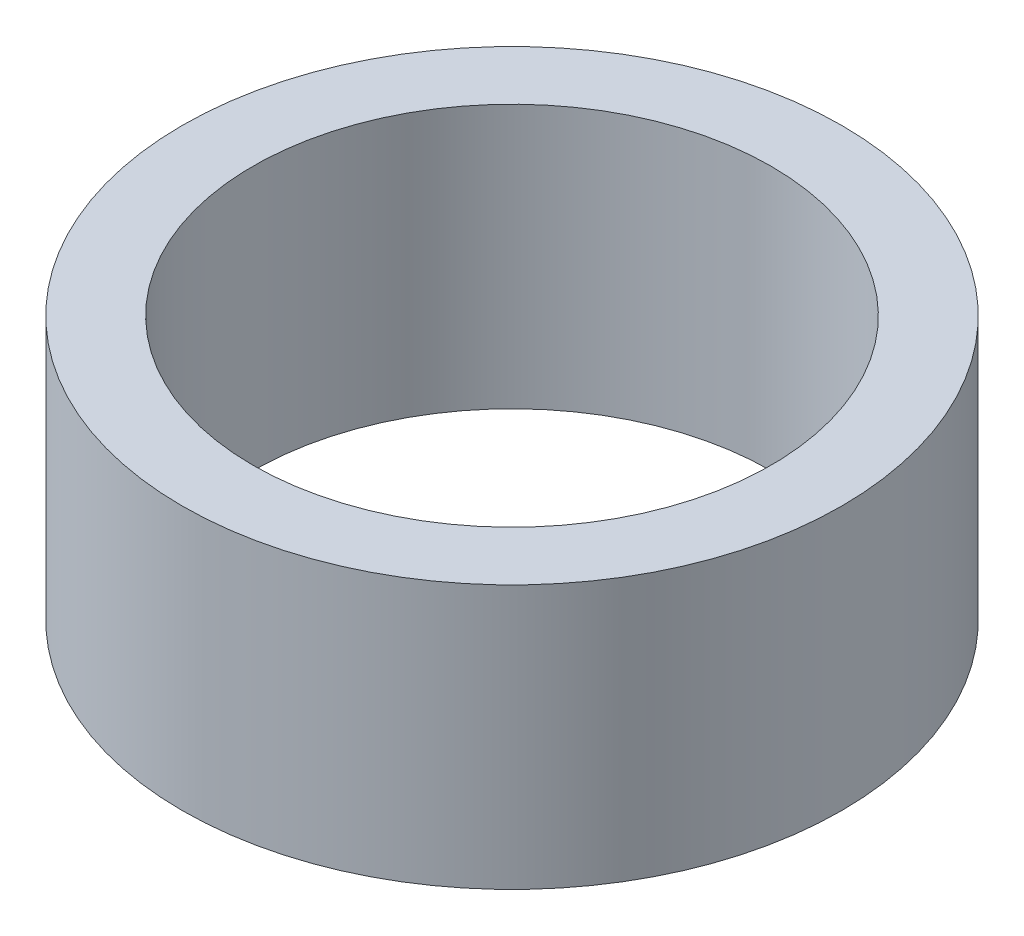
ISO-10303-21;
HEADER;
FILE_DESCRIPTION(('STEP AP214'),'2;1');
FILE_NAME('part.step','',(''),(''),'','','');
FILE_SCHEMA(('AUTOMOTIVE_DESIGN { 1 0 10303 214 1 1 1 1 }'));
ENDSEC;
DATA;
#1=APPLICATION_CONTEXT('core data for automotive mechanical design processes');
#2=APPLICATION_PROTOCOL_DEFINITION('international standard','automotive_design',2000,#1);
#3=PRODUCT_CONTEXT('',#1,'mechanical');
#4=PRODUCT('Part','Part','',(#3));
#5=PRODUCT_RELATED_PRODUCT_CATEGORY('part','',(#4));
#6=PRODUCT_DEFINITION_FORMATION('','',#4);
#7=PRODUCT_DEFINITION_CONTEXT('part definition',#1,'design');
#8=PRODUCT_DEFINITION('design','',#6,#7);
#9=PRODUCT_DEFINITION_SHAPE('','',#8);
#10=(LENGTH_UNIT() NAMED_UNIT(*) SI_UNIT(.MILLI.,.METRE.));
#11=(NAMED_UNIT(*) PLANE_ANGLE_UNIT() SI_UNIT($,.RADIAN.));
#12=(NAMED_UNIT(*) SI_UNIT($,.STERADIAN.) SOLID_ANGLE_UNIT());
#13=UNCERTAINTY_MEASURE_WITH_UNIT(LENGTH_MEASURE(1.E-05),#10,'distance_accuracy_value','');
#14=(GEOMETRIC_REPRESENTATION_CONTEXT(3) GLOBAL_UNCERTAINTY_ASSIGNED_CONTEXT((#13)) GLOBAL_UNIT_ASSIGNED_CONTEXT((#10,
#11,#12)) REPRESENTATION_CONTEXT('',''));
#15=CARTESIAN_POINT('',(0.,0.,0.));
#16=DIRECTION('',(0.,0.,1.));
#17=DIRECTION('',(1.,0.,0.));
#18=AXIS2_PLACEMENT_3D('',#15,#16,#17);
#19=CARTESIAN_POINT('',(0.,28.,0.));
#20=DIRECTION('',(0.,-1.,0.));
#21=DIRECTION('',(0.,0.,-1.));
#22=AXIS2_PLACEMENT_3D('',#19,#20,#21);
#23=CYLINDRICAL_SURFACE('',#22,35.);
#24=CARTESIAN_POINT('',(0.,28.,0.));
#25=DIRECTION('',(0.,1.,0.));
#26=DIRECTION('',(0.,0.,1.));
#27=AXIS2_PLACEMENT_3D('',#24,#25,#26);
#28=CIRCLE('',#27,35.);
#29=CARTESIAN_POINT('',(0.,28.,35.));
#30=VERTEX_POINT('',#29);
#31=EDGE_CURVE('E10',#30,#30,#28,.T.);
#32=ORIENTED_EDGE('',*,*,#31,.F.);
#33=EDGE_LOOP('',(#32));
#34=FACE_BOUND('',#33,.T.);
#35=CARTESIAN_POINT('',(0.,0.,0.));
#36=DIRECTION('',(0.,1.,0.));
#37=DIRECTION('',(0.,0.,1.));
#38=AXIS2_PLACEMENT_3D('',#35,#36,#37);
#39=CIRCLE('',#38,35.);
#40=CARTESIAN_POINT('',(0.,0.,35.));
#41=VERTEX_POINT('',#40);
#42=EDGE_CURVE('E37',#41,#41,#39,.T.);
#43=ORIENTED_EDGE('',*,*,#42,.T.);
#44=EDGE_LOOP('',(#43));
#45=FACE_BOUND('',#44,.T.);
#46=ADVANCED_FACE('F40',(#34,#45),#23,.T.);
#47=CARTESIAN_POINT('',(0.,28.,0.));
#48=DIRECTION('',(0.,1.,0.));
#49=DIRECTION('',(0.,0.,1.));
#50=AXIS2_PLACEMENT_3D('',#47,#48,#49);
#51=PLANE('',#50);
#52=CARTESIAN_POINT('',(0.,28.,0.));
#53=DIRECTION('',(0.,1.,0.));
#54=DIRECTION('',(0.,0.,1.));
#55=AXIS2_PLACEMENT_3D('',#52,#53,#54);
#56=CIRCLE('',#55,27.5);
#57=CARTESIAN_POINT('',(0.,28.,27.5));
#58=VERTEX_POINT('',#57);
#59=EDGE_CURVE('E50',#58,#58,#56,.T.);
#60=ORIENTED_EDGE('',*,*,#59,.F.);
#61=EDGE_LOOP('',(#60));
#62=FACE_BOUND('',#61,.T.);
#63=ORIENTED_EDGE('',*,*,#31,.T.);
#64=EDGE_LOOP('',(#63));
#65=FACE_BOUND('',#64,.T.);
#66=ADVANCED_FACE('F59',(#62,#65),#51,.T.);
#67=CARTESIAN_POINT('',(0.,0.,0.));
#68=DIRECTION('',(0.,1.,0.));
#69=DIRECTION('',(0.,0.,1.));
#70=AXIS2_PLACEMENT_3D('',#67,#68,#69);
#71=PLANE('',#70);
#72=CARTESIAN_POINT('',(0.,0.,0.));
#73=DIRECTION('',(0.,1.,0.));
#74=DIRECTION('',(0.,0.,1.));
#75=AXIS2_PLACEMENT_3D('',#72,#73,#74);
#76=CIRCLE('',#75,27.5);
#77=CARTESIAN_POINT('',(0.,0.,27.5));
#78=VERTEX_POINT('',#77);
#79=EDGE_CURVE('E47',#78,#78,#76,.T.);
#80=ORIENTED_EDGE('',*,*,#79,.T.);
#81=EDGE_LOOP('',(#80));
#82=FACE_BOUND('',#81,.T.);
#83=ORIENTED_EDGE('',*,*,#42,.F.);
#84=EDGE_LOOP('',(#83));
#85=FACE_BOUND('',#84,.T.);
#86=ADVANCED_FACE('F58',(#82,#85),#71,.F.);
#87=CARTESIAN_POINT('',(0.,28.,0.));
#88=DIRECTION('',(0.,-1.,0.));
#89=DIRECTION('',(0.,0.,-1.));
#90=AXIS2_PLACEMENT_3D('',#87,#88,#89);
#91=CYLINDRICAL_SURFACE('',#90,27.5);
#92=ORIENTED_EDGE('',*,*,#59,.T.);
#93=EDGE_LOOP('',(#92));
#94=FACE_BOUND('',#93,.T.);
#95=ORIENTED_EDGE('',*,*,#79,.F.);
#96=EDGE_LOOP('',(#95));
#97=FACE_BOUND('',#96,.T.);
#98=ADVANCED_FACE('F54',(#94,#97),#91,.F.);
#99=CLOSED_SHELL('',(#46,#66,#86,#98));
#100=MANIFOLD_SOLID_BREP('B2',#99);
#101=ADVANCED_BREP_SHAPE_REPRESENTATION('',(#18,#100),#14);
#102=SHAPE_DEFINITION_REPRESENTATION(#9,#101);
ENDSEC;
END-ISO-10303-21;
